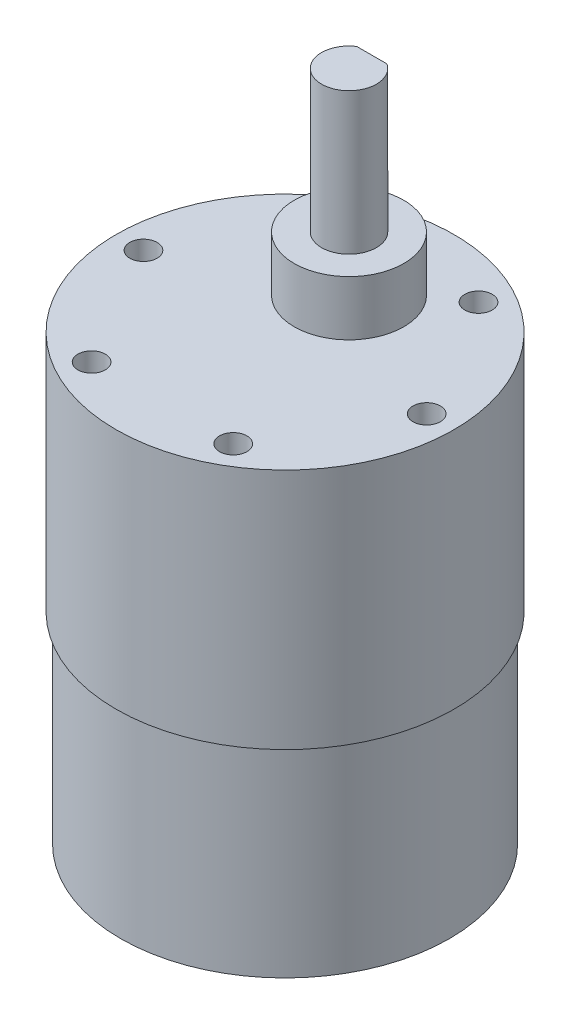
ISO-10303-21;
HEADER;
FILE_DESCRIPTION(('STEP AP214'),'2;1');
FILE_NAME('part.step','',(''),(''),'','','');
FILE_SCHEMA(('AUTOMOTIVE_DESIGN { 1 0 10303 214 1 1 1 1 }'));
ENDSEC;
DATA;
#1=APPLICATION_CONTEXT('core data for automotive mechanical design processes');
#2=APPLICATION_PROTOCOL_DEFINITION('international standard','automotive_design',2000,#1);
#3=PRODUCT_CONTEXT('',#1,'mechanical');
#4=PRODUCT('Part','Part','',(#3));
#5=PRODUCT_RELATED_PRODUCT_CATEGORY('part','',(#4));
#6=PRODUCT_DEFINITION_FORMATION('','',#4);
#7=PRODUCT_DEFINITION_CONTEXT('part definition',#1,'design');
#8=PRODUCT_DEFINITION('design','',#6,#7);
#9=PRODUCT_DEFINITION_SHAPE('','',#8);
#10=(LENGTH_UNIT() NAMED_UNIT(*) SI_UNIT(.MILLI.,.METRE.));
#11=(NAMED_UNIT(*) PLANE_ANGLE_UNIT() SI_UNIT($,.RADIAN.));
#12=(NAMED_UNIT(*) SI_UNIT($,.STERADIAN.) SOLID_ANGLE_UNIT());
#13=UNCERTAINTY_MEASURE_WITH_UNIT(LENGTH_MEASURE(1.E-05),#10,'distance_accuracy_value','');
#14=(GEOMETRIC_REPRESENTATION_CONTEXT(3) GLOBAL_UNCERTAINTY_ASSIGNED_CONTEXT((#13)) GLOBAL_UNIT_ASSIGNED_CONTEXT((#10,
#11,#12)) REPRESENTATION_CONTEXT('',''));
#15=CARTESIAN_POINT('',(0.,0.,0.));
#16=DIRECTION('',(0.,0.,1.));
#17=DIRECTION('',(1.,0.,0.));
#18=AXIS2_PLACEMENT_3D('',#15,#16,#17);
#19=CARTESIAN_POINT('',(0.,22.,0.));
#20=DIRECTION('',(0.,-1.,0.));
#21=DIRECTION('',(0.,0.,-1.));
#22=AXIS2_PLACEMENT_3D('',#19,#20,#21);
#23=CYLINDRICAL_SURFACE('',#22,18.);
#24=CARTESIAN_POINT('',(0.,22.,0.));
#25=DIRECTION('',(0.,1.,0.));
#26=DIRECTION('',(0.,0.,1.));
#27=AXIS2_PLACEMENT_3D('',#24,#25,#26);
#28=CIRCLE('',#27,18.);
#29=CARTESIAN_POINT('',(0.,22.,18.));
#30=VERTEX_POINT('',#29);
#31=EDGE_CURVE('E51',#30,#30,#28,.T.);
#32=ORIENTED_EDGE('',*,*,#31,.F.);
#33=EDGE_LOOP('',(#32));
#34=FACE_BOUND('',#33,.T.);
#35=CARTESIAN_POINT('',(0.,0.,0.));
#36=DIRECTION('',(0.,1.,0.));
#37=DIRECTION('',(0.,0.,1.));
#38=AXIS2_PLACEMENT_3D('',#35,#36,#37);
#39=CIRCLE('',#38,18.);
#40=CARTESIAN_POINT('',(0.,0.,18.));
#41=VERTEX_POINT('',#40);
#42=EDGE_CURVE('E45',#41,#41,#39,.T.);
#43=ORIENTED_EDGE('',*,*,#42,.T.);
#44=EDGE_LOOP('',(#43));
#45=FACE_BOUND('',#44,.T.);
#46=ADVANCED_FACE('F42',(#34,#45),#23,.T.);
#47=CARTESIAN_POINT('',(0.,0.,0.));
#48=DIRECTION('',(0.,1.,0.));
#49=DIRECTION('',(0.,0.,1.));
#50=AXIS2_PLACEMENT_3D('',#47,#48,#49);
#51=PLANE('',#50);
#52=ORIENTED_EDGE('',*,*,#42,.F.);
#53=EDGE_LOOP('',(#52));
#54=FACE_BOUND('',#53,.T.);
#55=ADVANCED_FACE('F196',(#54),#51,.F.);
#56=CARTESIAN_POINT('',(0.,48.5,0.));
#57=DIRECTION('',(0.,-1.,0.));
#58=DIRECTION('',(0.,0.,-1.));
#59=AXIS2_PLACEMENT_3D('',#56,#57,#58);
#60=CYLINDRICAL_SURFACE('',#59,18.5);
#61=CARTESIAN_POINT('',(0.,48.5,0.));
#62=DIRECTION('',(0.,1.,0.));
#63=DIRECTION('',(0.,0.,1.));
#64=AXIS2_PLACEMENT_3D('',#61,#62,#63);
#65=CIRCLE('',#64,18.5);
#66=CARTESIAN_POINT('',(0.,48.5,18.5));
#67=VERTEX_POINT('',#66);
#68=EDGE_CURVE('E181',#67,#67,#65,.T.);
#69=ORIENTED_EDGE('',*,*,#68,.F.);
#70=EDGE_LOOP('',(#69));
#71=FACE_BOUND('',#70,.T.);
#72=CARTESIAN_POINT('',(0.,22.,0.));
#73=DIRECTION('',(0.,1.,0.));
#74=DIRECTION('',(0.,0.,1.));
#75=AXIS2_PLACEMENT_3D('',#72,#73,#74);
#76=CIRCLE('',#75,18.5);
#77=CARTESIAN_POINT('',(0.,22.,18.5));
#78=VERTEX_POINT('',#77);
#79=EDGE_CURVE('E177',#78,#78,#76,.T.);
#80=ORIENTED_EDGE('',*,*,#79,.T.);
#81=EDGE_LOOP('',(#80));
#82=FACE_BOUND('',#81,.T.);
#83=ADVANCED_FACE('F198',(#71,#82),#60,.T.);
#84=CARTESIAN_POINT('',(0.,48.5,0.));
#85=DIRECTION('',(0.,1.,0.));
#86=DIRECTION('',(0.,0.,1.));
#87=AXIS2_PLACEMENT_3D('',#84,#85,#86);
#88=PLANE('',#87);
#89=CARTESIAN_POINT('',(0.,48.5,-7.));
#90=DIRECTION('',(0.,1.,0.));
#91=DIRECTION('',(0.,0.,1.));
#92=AXIS2_PLACEMENT_3D('',#89,#90,#91);
#93=CIRCLE('',#92,6.);
#94=CARTESIAN_POINT('',(0.,48.5,-0.999999999999999));
#95=VERTEX_POINT('',#94);
#96=EDGE_CURVE('E123',#95,#95,#93,.T.);
#97=ORIENTED_EDGE('',*,*,#96,.F.);
#98=EDGE_LOOP('',(#97));
#99=FACE_BOUND('',#98,.T.);
#100=CARTESIAN_POINT('',(-7.75000000000016,48.5,-13.4233937586587));
#101=DIRECTION('',(0.,1.,0.));
#102=DIRECTION('',(-0.866025403784433,0.,0.50000000000001));
#103=AXIS2_PLACEMENT_3D('',#100,#101,#102);
#104=CIRCLE('',#103,1.5);
#105=CARTESIAN_POINT('',(-9.04903810567681,48.5,-12.6733937586587));
#106=VERTEX_POINT('',#105);
#107=EDGE_CURVE('E129',#106,#106,#104,.T.);
#108=ORIENTED_EDGE('',*,*,#107,.F.);
#109=EDGE_LOOP('',(#108));
#110=FACE_BOUND('',#109,.T.);
#111=CARTESIAN_POINT('',(7.74999999999987,48.5,-13.4233937586589));
#112=DIRECTION('',(0.,1.,0.));
#113=DIRECTION('',(-0.866025403784443,0.,-0.499999999999992));
#114=AXIS2_PLACEMENT_3D('',#111,#112,#113);
#115=CIRCLE('',#114,1.5);
#116=CARTESIAN_POINT('',(6.45096189432321,48.5,-14.1733937586589));
#117=VERTEX_POINT('',#116);
#118=EDGE_CURVE('E154',#117,#117,#115,.T.);
#119=ORIENTED_EDGE('',*,*,#118,.F.);
#120=EDGE_LOOP('',(#119));
#121=FACE_BOUND('',#120,.T.);
#122=CARTESIAN_POINT('',(15.5,48.5,0.));
#123=DIRECTION('',(0.,1.,0.));
#124=DIRECTION('',(0.,0.,-1.));
#125=AXIS2_PLACEMENT_3D('',#122,#123,#124);
#126=CIRCLE('',#125,1.5);
#127=CARTESIAN_POINT('',(15.5,48.5,-1.5));
#128=VERTEX_POINT('',#127);
#129=EDGE_CURVE('E146',#128,#128,#126,.T.);
#130=ORIENTED_EDGE('',*,*,#129,.F.);
#131=EDGE_LOOP('',(#130));
#132=FACE_BOUND('',#131,.T.);
#133=CARTESIAN_POINT('',(7.75000000000006,48.5,13.4233937586588));
#134=DIRECTION('',(0.,1.,0.));
#135=DIRECTION('',(0.866025403784436,0.,-0.500000000000004));
#136=AXIS2_PLACEMENT_3D('',#133,#134,#135);
#137=CIRCLE('',#136,1.5);
#138=CARTESIAN_POINT('',(9.04903810567672,48.5,12.6733937586588));
#139=VERTEX_POINT('',#138);
#140=EDGE_CURVE('E138',#139,#139,#137,.T.);
#141=ORIENTED_EDGE('',*,*,#140,.F.);
#142=EDGE_LOOP('',(#141));
#143=FACE_BOUND('',#142,.T.);
#144=CARTESIAN_POINT('',(-7.74999999999997,48.5,13.4233937586588));
#145=DIRECTION('',(0.,1.,0.));
#146=DIRECTION('',(0.86602540378444,0.,0.499999999999998));
#147=AXIS2_PLACEMENT_3D('',#144,#145,#146);
#148=CIRCLE('',#147,1.5);
#149=CARTESIAN_POINT('',(-6.45096189432331,48.5,14.1733937586588));
#150=VERTEX_POINT('',#149);
#151=EDGE_CURVE('E137',#150,#150,#148,.T.);
#152=ORIENTED_EDGE('',*,*,#151,.F.);
#153=EDGE_LOOP('',(#152));
#154=FACE_BOUND('',#153,.T.);
#155=CARTESIAN_POINT('',(-15.5,48.5,0.));
#156=DIRECTION('',(0.,1.,0.));
#157=DIRECTION('',(0.,0.,1.));
#158=AXIS2_PLACEMENT_3D('',#155,#156,#157);
#159=CIRCLE('',#158,1.5);
#160=CARTESIAN_POINT('',(-15.5,48.5,1.5));
#161=VERTEX_POINT('',#160);
#162=EDGE_CURVE('E169',#161,#161,#159,.T.);
#163=ORIENTED_EDGE('',*,*,#162,.F.);
#164=EDGE_LOOP('',(#163));
#165=FACE_BOUND('',#164,.T.);
#166=ORIENTED_EDGE('',*,*,#68,.T.);
#167=EDGE_LOOP('',(#166));
#168=FACE_BOUND('',#167,.T.);
#169=ADVANCED_FACE('F203',(#99,#110,#121,#132,#143,#154,#165,#168),#88,.T.);
#170=CARTESIAN_POINT('',(0.,22.,0.));
#171=DIRECTION('',(0.,1.,0.));
#172=DIRECTION('',(0.,0.,1.));
#173=AXIS2_PLACEMENT_3D('',#170,#171,#172);
#174=PLANE('',#173);
#175=ORIENTED_EDGE('',*,*,#31,.T.);
#176=EDGE_LOOP('',(#175));
#177=FACE_BOUND('',#176,.T.);
#178=ORIENTED_EDGE('',*,*,#79,.F.);
#179=EDGE_LOOP('',(#178));
#180=FACE_BOUND('',#179,.T.);
#181=ADVANCED_FACE('F208',(#177,#180),#174,.F.);
#182=CARTESIAN_POINT('',(-15.5,42.5,0.));
#183=DIRECTION('',(0.,1.,0.));
#184=DIRECTION('',(0.,0.,1.));
#185=AXIS2_PLACEMENT_3D('',#182,#183,#184);
#186=CYLINDRICAL_SURFACE('',#185,1.5);
#187=CARTESIAN_POINT('',(-15.5,42.5,0.));
#188=DIRECTION('',(0.,1.,0.));
#189=DIRECTION('',(0.,0.,1.));
#190=AXIS2_PLACEMENT_3D('',#187,#188,#189);
#191=CIRCLE('',#190,1.5);
#192=CARTESIAN_POINT('',(-15.5,42.5,1.5));
#193=VERTEX_POINT('',#192);
#194=EDGE_CURVE('E173',#193,#193,#191,.T.);
#195=ORIENTED_EDGE('',*,*,#194,.F.);
#196=EDGE_LOOP('',(#195));
#197=FACE_BOUND('',#196,.T.);
#198=ORIENTED_EDGE('',*,*,#162,.T.);
#199=EDGE_LOOP('',(#198));
#200=FACE_BOUND('',#199,.T.);
#201=ADVANCED_FACE('F211',(#197,#200),#186,.F.);
#202=CARTESIAN_POINT('',(-15.5,42.5,0.));
#203=DIRECTION('',(0.,1.,0.));
#204=DIRECTION('',(0.,0.,1.));
#205=AXIS2_PLACEMENT_3D('',#202,#203,#204);
#206=PLANE('',#205);
#207=ORIENTED_EDGE('',*,*,#194,.T.);
#208=EDGE_LOOP('',(#207));
#209=FACE_BOUND('',#208,.T.);
#210=ADVANCED_FACE('F217',(#209),#206,.T.);
#211=CARTESIAN_POINT('',(-7.74999999999997,42.5,13.4233937586588));
#212=DIRECTION('',(0.,1.,0.));
#213=DIRECTION('',(0.,0.,1.));
#214=AXIS2_PLACEMENT_3D('',#211,#212,#213);
#215=CYLINDRICAL_SURFACE('',#214,1.5);
#216=CARTESIAN_POINT('',(-7.74999999999997,42.5,13.4233937586588));
#217=DIRECTION('',(0.,1.,0.));
#218=DIRECTION('',(0.86602540378444,0.,0.499999999999998));
#219=AXIS2_PLACEMENT_3D('',#216,#217,#218);
#220=CIRCLE('',#219,1.5);
#221=CARTESIAN_POINT('',(-6.45096189432331,42.5,14.1733937586588));
#222=VERTEX_POINT('',#221);
#223=EDGE_CURVE('E165',#222,#222,#220,.T.);
#224=ORIENTED_EDGE('',*,*,#223,.F.);
#225=EDGE_LOOP('',(#224));
#226=FACE_BOUND('',#225,.T.);
#227=ORIENTED_EDGE('',*,*,#151,.T.);
#228=EDGE_LOOP('',(#227));
#229=FACE_BOUND('',#228,.T.);
#230=ADVANCED_FACE('F221',(#226,#229),#215,.F.);
#231=CARTESIAN_POINT('',(-7.74999999999997,42.5,13.4233937586588));
#232=DIRECTION('',(0.,1.,0.));
#233=DIRECTION('',(0.86602540378444,0.,0.499999999999998));
#234=AXIS2_PLACEMENT_3D('',#231,#232,#233);
#235=PLANE('',#234);
#236=ORIENTED_EDGE('',*,*,#223,.T.);
#237=EDGE_LOOP('',(#236));
#238=FACE_BOUND('',#237,.T.);
#239=ADVANCED_FACE('F225',(#238),#235,.T.);
#240=CARTESIAN_POINT('',(7.75000000000006,42.5,13.4233937586588));
#241=DIRECTION('',(0.,1.,0.));
#242=DIRECTION('',(0.,0.,1.));
#243=AXIS2_PLACEMENT_3D('',#240,#241,#242);
#244=CYLINDRICAL_SURFACE('',#243,1.5);
#245=CARTESIAN_POINT('',(7.75000000000006,42.5,13.4233937586588));
#246=DIRECTION('',(0.,1.,0.));
#247=DIRECTION('',(0.866025403784436,0.,-0.500000000000004));
#248=AXIS2_PLACEMENT_3D('',#245,#246,#247);
#249=CIRCLE('',#248,1.5);
#250=CARTESIAN_POINT('',(9.04903810567672,42.5,12.6733937586588));
#251=VERTEX_POINT('',#250);
#252=EDGE_CURVE('E133',#251,#251,#249,.T.);
#253=ORIENTED_EDGE('',*,*,#252,.F.);
#254=EDGE_LOOP('',(#253));
#255=FACE_BOUND('',#254,.T.);
#256=ORIENTED_EDGE('',*,*,#140,.T.);
#257=EDGE_LOOP('',(#256));
#258=FACE_BOUND('',#257,.T.);
#259=ADVANCED_FACE('F229',(#255,#258),#244,.F.);
#260=CARTESIAN_POINT('',(7.75000000000006,42.5,13.4233937586588));
#261=DIRECTION('',(0.,1.,0.));
#262=DIRECTION('',(0.866025403784436,0.,-0.500000000000004));
#263=AXIS2_PLACEMENT_3D('',#260,#261,#262);
#264=PLANE('',#263);
#265=ORIENTED_EDGE('',*,*,#252,.T.);
#266=EDGE_LOOP('',(#265));
#267=FACE_BOUND('',#266,.T.);
#268=ADVANCED_FACE('F252',(#267),#264,.T.);
#269=CARTESIAN_POINT('',(15.5,42.5,0.));
#270=DIRECTION('',(0.,1.,0.));
#271=DIRECTION('',(0.,0.,1.));
#272=AXIS2_PLACEMENT_3D('',#269,#270,#271);
#273=CYLINDRICAL_SURFACE('',#272,1.5);
#274=CARTESIAN_POINT('',(15.5,42.5,0.));
#275=DIRECTION('',(0.,1.,0.));
#276=DIRECTION('',(0.,0.,-1.));
#277=AXIS2_PLACEMENT_3D('',#274,#275,#276);
#278=CIRCLE('',#277,1.5);
#279=CARTESIAN_POINT('',(15.5,42.5,-1.5));
#280=VERTEX_POINT('',#279);
#281=EDGE_CURVE('E142',#280,#280,#278,.T.);
#282=ORIENTED_EDGE('',*,*,#281,.F.);
#283=EDGE_LOOP('',(#282));
#284=FACE_BOUND('',#283,.T.);
#285=ORIENTED_EDGE('',*,*,#129,.T.);
#286=EDGE_LOOP('',(#285));
#287=FACE_BOUND('',#286,.T.);
#288=ADVANCED_FACE('F249',(#284,#287),#273,.F.);
#289=CARTESIAN_POINT('',(15.5,42.5,0.));
#290=DIRECTION('',(0.,1.,0.));
#291=DIRECTION('',(0.,0.,-1.));
#292=AXIS2_PLACEMENT_3D('',#289,#290,#291);
#293=PLANE('',#292);
#294=ORIENTED_EDGE('',*,*,#281,.T.);
#295=EDGE_LOOP('',(#294));
#296=FACE_BOUND('',#295,.T.);
#297=ADVANCED_FACE('F244',(#296),#293,.T.);
#298=CARTESIAN_POINT('',(7.74999999999987,42.5,-13.4233937586589));
#299=DIRECTION('',(0.,1.,0.));
#300=DIRECTION('',(0.,0.,1.));
#301=AXIS2_PLACEMENT_3D('',#298,#299,#300);
#302=CYLINDRICAL_SURFACE('',#301,1.5);
#303=CARTESIAN_POINT('',(7.74999999999987,42.5,-13.4233937586589));
#304=DIRECTION('',(0.,1.,0.));
#305=DIRECTION('',(-0.866025403784443,0.,-0.499999999999992));
#306=AXIS2_PLACEMENT_3D('',#303,#304,#305);
#307=CIRCLE('',#306,1.5);
#308=CARTESIAN_POINT('',(6.45096189432321,42.5,-14.1733937586589));
#309=VERTEX_POINT('',#308);
#310=EDGE_CURVE('E150',#309,#309,#307,.T.);
#311=ORIENTED_EDGE('',*,*,#310,.F.);
#312=EDGE_LOOP('',(#311));
#313=FACE_BOUND('',#312,.T.);
#314=ORIENTED_EDGE('',*,*,#118,.T.);
#315=EDGE_LOOP('',(#314));
#316=FACE_BOUND('',#315,.T.);
#317=ADVANCED_FACE('F241',(#313,#316),#302,.F.);
#318=CARTESIAN_POINT('',(7.74999999999987,42.5,-13.4233937586589));
#319=DIRECTION('',(0.,1.,0.));
#320=DIRECTION('',(-0.866025403784443,0.,-0.499999999999992));
#321=AXIS2_PLACEMENT_3D('',#318,#319,#320);
#322=PLANE('',#321);
#323=ORIENTED_EDGE('',*,*,#310,.T.);
#324=EDGE_LOOP('',(#323));
#325=FACE_BOUND('',#324,.T.);
#326=ADVANCED_FACE('F235',(#325),#322,.T.);
#327=CARTESIAN_POINT('',(-7.75000000000016,42.5,-13.4233937586587));
#328=DIRECTION('',(0.,1.,0.));
#329=DIRECTION('',(0.,0.,1.));
#330=AXIS2_PLACEMENT_3D('',#327,#328,#329);
#331=CYLINDRICAL_SURFACE('',#330,1.5);
#332=CARTESIAN_POINT('',(-7.75000000000016,42.5,-13.4233937586587));
#333=DIRECTION('',(0.,1.,0.));
#334=DIRECTION('',(-0.866025403784433,0.,0.50000000000001));
#335=AXIS2_PLACEMENT_3D('',#332,#333,#334);
#336=CIRCLE('',#335,1.5);
#337=CARTESIAN_POINT('',(-9.04903810567681,42.5,-12.6733937586587));
#338=VERTEX_POINT('',#337);
#339=EDGE_CURVE('E158',#338,#338,#336,.T.);
#340=ORIENTED_EDGE('',*,*,#339,.F.);
#341=EDGE_LOOP('',(#340));
#342=FACE_BOUND('',#341,.T.);
#343=ORIENTED_EDGE('',*,*,#107,.T.);
#344=EDGE_LOOP('',(#343));
#345=FACE_BOUND('',#344,.T.);
#346=ADVANCED_FACE('F231',(#342,#345),#331,.F.);
#347=CARTESIAN_POINT('',(-7.75000000000016,42.5,-13.4233937586587));
#348=DIRECTION('',(0.,1.,0.));
#349=DIRECTION('',(-0.866025403784433,0.,0.50000000000001));
#350=AXIS2_PLACEMENT_3D('',#347,#348,#349);
#351=PLANE('',#350);
#352=ORIENTED_EDGE('',*,*,#339,.T.);
#353=EDGE_LOOP('',(#352));
#354=FACE_BOUND('',#353,.T.);
#355=ADVANCED_FACE('F234',(#354),#351,.T.);
#356=CARTESIAN_POINT('',(0.,54.5,-7.));
#357=DIRECTION('',(0.,-1.,0.));
#358=DIRECTION('',(0.,0.,-1.));
#359=AXIS2_PLACEMENT_3D('',#356,#357,#358);
#360=CYLINDRICAL_SURFACE('',#359,6.);
#361=CARTESIAN_POINT('',(0.,54.5,-7.));
#362=DIRECTION('',(0.,1.,0.));
#363=DIRECTION('',(0.,0.,1.));
#364=AXIS2_PLACEMENT_3D('',#361,#362,#363);
#365=CIRCLE('',#364,6.);
#366=CARTESIAN_POINT('',(0.,54.5,-0.999999999999999));
#367=VERTEX_POINT('',#366);
#368=EDGE_CURVE('E125',#367,#367,#365,.T.);
#369=ORIENTED_EDGE('',*,*,#368,.F.);
#370=EDGE_LOOP('',(#369));
#371=FACE_BOUND('',#370,.T.);
#372=ORIENTED_EDGE('',*,*,#96,.T.);
#373=EDGE_LOOP('',(#372));
#374=FACE_BOUND('',#373,.T.);
#375=ADVANCED_FACE('F239',(#371,#374),#360,.T.);
#376=CARTESIAN_POINT('',(0.,54.5,-7.));
#377=DIRECTION('',(0.,1.,0.));
#378=DIRECTION('',(0.,0.,1.));
#379=AXIS2_PLACEMENT_3D('',#376,#377,#378);
#380=PLANE('',#379);
#381=CARTESIAN_POINT('',(0.,54.5,-7.));
#382=DIRECTION('',(0.,1.,0.));
#383=DIRECTION('',(0.,0.,1.));
#384=AXIS2_PLACEMENT_3D('',#381,#382,#383);
#385=CIRCLE('',#384,3.);
#386=CARTESIAN_POINT('',(0.,54.5,-4.));
#387=VERTEX_POINT('',#386);
#388=EDGE_CURVE('E11',#387,#387,#385,.T.);
#389=ORIENTED_EDGE('',*,*,#388,.F.);
#390=EDGE_LOOP('',(#389));
#391=FACE_BOUND('',#390,.T.);
#392=ORIENTED_EDGE('',*,*,#368,.T.);
#393=EDGE_LOOP('',(#392));
#394=FACE_BOUND('',#393,.T.);
#395=ADVANCED_FACE('F265',(#391,#394),#380,.T.);
#396=CARTESIAN_POINT('',(0.,70.,-7.));
#397=DIRECTION('',(0.,-1.,0.));
#398=DIRECTION('',(0.,0.,-1.));
#399=AXIS2_PLACEMENT_3D('',#396,#397,#398);
#400=CYLINDRICAL_SURFACE('',#399,3.);
#401=CARTESIAN_POINT('',(0.,70.,-7.));
#402=DIRECTION('',(0.,1.,0.));
#403=DIRECTION('',(0.,0.,1.));
#404=AXIS2_PLACEMENT_3D('',#401,#402,#403);
#405=CIRCLE('',#404,3.);
#406=CARTESIAN_POINT('',(-1.65830378738592,70.,-9.50000570974178));
#407=VERTEX_POINT('',#406);
#408=CARTESIAN_POINT('',(1.65830378738592,70.,-9.50000570974178));
#409=VERTEX_POINT('',#408);
#410=EDGE_CURVE('E75',#407,#409,#405,.T.);
#411=ORIENTED_EDGE('',*,*,#410,.F.);
#412=DIRECTION('',(0.,-1.,0.));
#413=VECTOR('',#412,1.);
#414=CARTESIAN_POINT('',(-1.6583,239.244565082204,-9.5));
#415=LINE('',#414,#413);
#416=CARTESIAN_POINT('',(-1.65830189369296,58.0000000000001,-9.50000285487089));
#417=VERTEX_POINT('',#416);
#418=EDGE_CURVE('E72',#407,#417,#415,.T.);
#419=ORIENTED_EDGE('',*,*,#418,.T.);
#420=CARTESIAN_POINT('',(0.,58.,-7.));
#421=DIRECTION('',(0.,1.,0.));
#422=DIRECTION('',(0.,0.,1.));
#423=AXIS2_PLACEMENT_3D('',#420,#421,#422);
#424=CIRCLE('',#423,3.);
#425=CARTESIAN_POINT('',(1.65830809128181,58.0000000000001,-9.50000285487089));
#426=VERTEX_POINT('',#425);
#427=EDGE_CURVE('E59',#426,#417,#424,.T.);
#428=ORIENTED_EDGE('',*,*,#427,.F.);
#429=DIRECTION('',(0.,-1.,0.));
#430=VECTOR('',#429,1.);
#431=CARTESIAN_POINT('',(1.6583,239.244565082204,-9.5));
#432=LINE('',#431,#430);
#433=EDGE_CURVE('E79',#409,#426,#432,.T.);
#434=ORIENTED_EDGE('',*,*,#433,.F.);
#435=EDGE_LOOP('',(#411,#419,#428,#434));
#436=FACE_BOUND('',#435,.T.);
#437=ORIENTED_EDGE('',*,*,#388,.T.);
#438=EDGE_LOOP('',(#437));
#439=FACE_BOUND('',#438,.T.);
#440=ADVANCED_FACE('F73',(#436,#439),#400,.T.);
#441=CARTESIAN_POINT('',(0.,70.,-7.));
#442=DIRECTION('',(0.,1.,0.));
#443=DIRECTION('',(0.,0.,1.));
#444=AXIS2_PLACEMENT_3D('',#441,#442,#443);
#445=PLANE('',#444);
#446=DIRECTION('',(1.,0.,0.));
#447=VECTOR('',#446,1.);
#448=CARTESIAN_POINT('',(-1.6583,70.,-9.5));
#449=LINE('',#448,#447);
#450=EDGE_CURVE('E66',#407,#409,#449,.T.);
#451=ORIENTED_EDGE('',*,*,#450,.F.);
#452=ORIENTED_EDGE('',*,*,#410,.T.);
#453=EDGE_LOOP('',(#451,#452));
#454=FACE_BOUND('',#453,.T.);
#455=ADVANCED_FACE('F105',(#454),#445,.T.);
#456=CARTESIAN_POINT('',(-1.6583,239.244565082204,-9.5));
#457=DIRECTION('',(0.,0.,-1.));
#458=DIRECTION('',(-1.,0.,0.));
#459=AXIS2_PLACEMENT_3D('',#456,#457,#458);
#460=PLANE('',#459);
#461=ORIENTED_EDGE('',*,*,#418,.F.);
#462=ORIENTED_EDGE('',*,*,#450,.T.);
#463=ORIENTED_EDGE('',*,*,#433,.T.);
#464=CARTESIAN_POINT('',(-1.65830378738592,58.,-9.50000570974178));
#465=DIRECTION('',(1.,0.,0.));
#466=VECTOR('',#465,1.);
#467=LINE('',#464,#466);
#468=EDGE_CURVE('E83',#417,#426,#467,.T.);
#469=ORIENTED_EDGE('',*,*,#468,.F.);
#470=EDGE_LOOP('',(#461,#462,#463,#469));
#471=FACE_BOUND('',#470,.T.);
#472=ADVANCED_FACE('F89',(#471),#460,.T.);
#473=CARTESIAN_POINT('',(0.,58.,-7.));
#474=DIRECTION('',(0.,1.,0.));
#475=DIRECTION('',(0.,0.,1.));
#476=AXIS2_PLACEMENT_3D('',#473,#474,#475);
#477=PLANE('',#476);
#478=ORIENTED_EDGE('',*,*,#468,.T.);
#479=ORIENTED_EDGE('',*,*,#427,.T.);
#480=EDGE_LOOP('',(#478,#479));
#481=FACE_BOUND('',#480,.T.);
#482=ADVANCED_FACE('F82',(#481),#477,.T.);
#483=CLOSED_SHELL('',(#46,#55,#83,#169,#181,#201,#210,#230,#239,#259,#268,#288,#297,#317,#326,
#346,#355,#375,#395,#440,#455,#472,#482));
#484=MANIFOLD_SOLID_BREP('B2',#483);
#485=ADVANCED_BREP_SHAPE_REPRESENTATION('',(#18,#484),#14);
#486=SHAPE_DEFINITION_REPRESENTATION(#9,#485);
ENDSEC;
END-ISO-10303-21;
